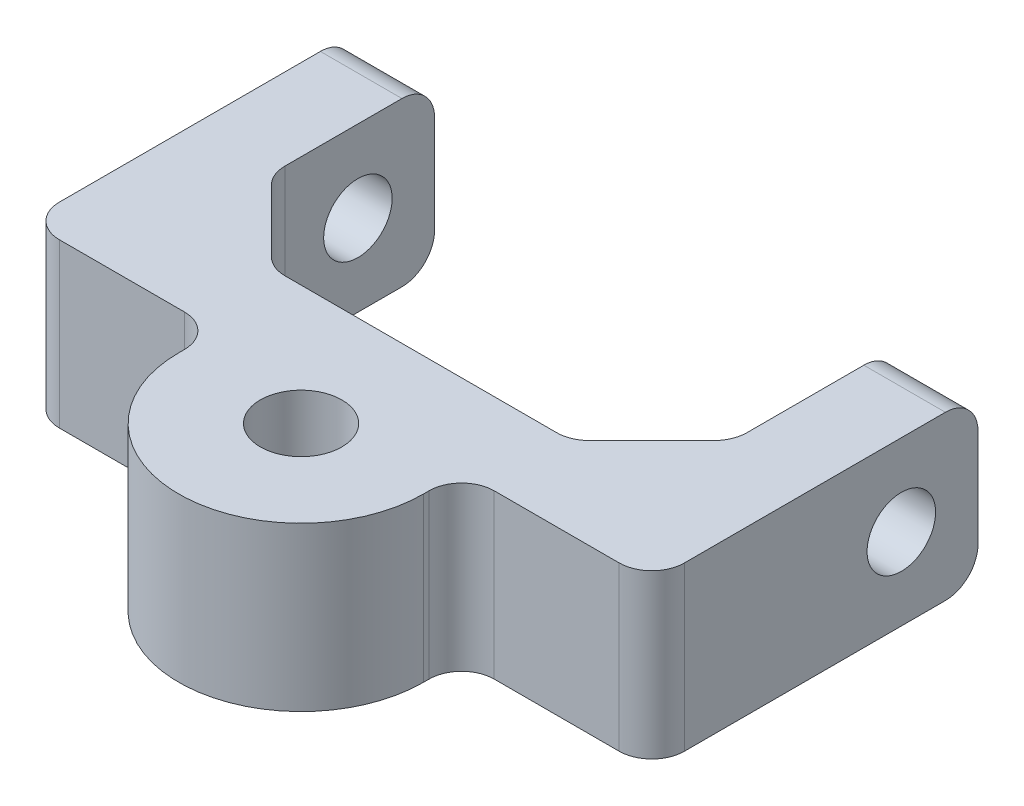
ISO-10303-21;
HEADER;
FILE_DESCRIPTION(('STEP AP214'),'2;1');
FILE_NAME('part.step','',(''),(''),'','','');
FILE_SCHEMA(('AUTOMOTIVE_DESIGN { 1 0 10303 214 1 1 1 1 }'));
ENDSEC;
DATA;
#1=APPLICATION_CONTEXT('core data for automotive mechanical design processes');
#2=APPLICATION_PROTOCOL_DEFINITION('international standard','automotive_design',2000,#1);
#3=PRODUCT_CONTEXT('',#1,'mechanical');
#4=PRODUCT('Part','Part','',(#3));
#5=PRODUCT_RELATED_PRODUCT_CATEGORY('part','',(#4));
#6=PRODUCT_DEFINITION_FORMATION('','',#4);
#7=PRODUCT_DEFINITION_CONTEXT('part definition',#1,'design');
#8=PRODUCT_DEFINITION('design','',#6,#7);
#9=PRODUCT_DEFINITION_SHAPE('','',#8);
#10=(LENGTH_UNIT() NAMED_UNIT(*) SI_UNIT(.MILLI.,.METRE.));
#11=(NAMED_UNIT(*) PLANE_ANGLE_UNIT() SI_UNIT($,.RADIAN.));
#12=(NAMED_UNIT(*) SI_UNIT($,.STERADIAN.) SOLID_ANGLE_UNIT());
#13=UNCERTAINTY_MEASURE_WITH_UNIT(LENGTH_MEASURE(1.E-05),#10,'distance_accuracy_value','');
#14=(GEOMETRIC_REPRESENTATION_CONTEXT(3) GLOBAL_UNCERTAINTY_ASSIGNED_CONTEXT((#13)) GLOBAL_UNIT_ASSIGNED_CONTEXT((#10,
#11,#12)) REPRESENTATION_CONTEXT('',''));
#15=CARTESIAN_POINT('',(0.,0.,0.));
#16=DIRECTION('',(0.,0.,1.));
#17=DIRECTION('',(1.,0.,0.));
#18=AXIS2_PLACEMENT_3D('',#15,#16,#17);
#19=CARTESIAN_POINT('',(-6.35,12.7,6.35));
#20=DIRECTION('',(0.,0.,-1.));
#21=DIRECTION('',(-1.,0.,0.));
#22=AXIS2_PLACEMENT_3D('',#19,#20,#21);
#23=PLANE('',#22);
#24=DIRECTION('',(1.,0.,0.));
#25=VECTOR('',#24,1.);
#26=CARTESIAN_POINT('',(-6.35,12.7,6.35));
#27=LINE('',#26,#25);
#28=CARTESIAN_POINT('',(-3.81,12.7,6.35));
#29=VERTEX_POINT('',#28);
#30=CARTESIAN_POINT('',(5.9182,12.7,6.35));
#31=VERTEX_POINT('',#30);
#32=EDGE_CURVE('E278',#29,#31,#27,.T.);
#33=ORIENTED_EDGE('',*,*,#32,.F.);
#34=DIRECTION('',(0.,-1.,0.));
#35=VECTOR('',#34,1.);
#36=CARTESIAN_POINT('',(-3.81,12.7,6.35));
#37=LINE('',#36,#35);
#38=CARTESIAN_POINT('',(-3.81,0.,6.35));
#39=VERTEX_POINT('',#38);
#40=EDGE_CURVE('E316',#29,#39,#37,.T.);
#41=ORIENTED_EDGE('',*,*,#40,.T.);
#42=DIRECTION('',(1.,0.,0.));
#43=VECTOR('',#42,1.);
#44=CARTESIAN_POINT('',(-6.35,0.,6.35));
#45=LINE('',#44,#43);
#46=CARTESIAN_POINT('',(5.9182,0.,6.35));
#47=VERTEX_POINT('',#46);
#48=EDGE_CURVE('E295',#39,#47,#45,.T.);
#49=ORIENTED_EDGE('',*,*,#48,.T.);
#50=DIRECTION('',(0.,-1.,0.));
#51=VECTOR('',#50,1.);
#52=CARTESIAN_POINT('',(5.9182,12.7,6.35));
#53=LINE('',#52,#51);
#54=EDGE_CURVE('E312',#47,#31,#53,.F.);
#55=ORIENTED_EDGE('',*,*,#54,.T.);
#56=EDGE_LOOP('',(#33,#41,#49,#55));
#57=FACE_BOUND('',#56,.T.);
#58=ADVANCED_FACE('F33',(#57),#23,.F.);
#59=CARTESIAN_POINT('',(0.,12.7,0.));
#60=DIRECTION('',(-1.,0.,0.));
#61=DIRECTION('',(0.,0.,1.));
#62=AXIS2_PLACEMENT_3D('',#59,#60,#61);
#63=PLANE('',#62);
#64=CARTESIAN_POINT('',(0.,6.35,-13.081));
#65=DIRECTION('',(-1.,0.,0.));
#66=DIRECTION('',(0.,0.,1.));
#67=AXIS2_PLACEMENT_3D('',#64,#65,#66);
#68=CIRCLE('',#67,2.667);
#69=CARTESIAN_POINT('',(0.,6.35,-10.414));
#70=VERTEX_POINT('',#69);
#71=EDGE_CURVE('E265',#70,#70,#68,.T.);
#72=ORIENTED_EDGE('',*,*,#71,.T.);
#73=EDGE_LOOP('',(#72));
#74=FACE_BOUND('',#73,.T.);
#75=DIRECTION('',(0.,-1.,0.));
#76=VECTOR('',#75,1.);
#77=CARTESIAN_POINT('',(0.,12.7,-19.05));
#78=LINE('',#77,#76);
#79=CARTESIAN_POINT('',(0.,10.16,-19.05));
#80=VERTEX_POINT('',#79);
#81=CARTESIAN_POINT('',(0.,2.54,-19.05));
#82=VERTEX_POINT('',#81);
#83=EDGE_CURVE('E309',#80,#82,#78,.T.);
#84=ORIENTED_EDGE('',*,*,#83,.F.);
#85=CARTESIAN_POINT('',(0.,10.16,-16.51));
#86=DIRECTION('',(-1.,0.,0.));
#87=DIRECTION('',(0.,0.,1.));
#88=AXIS2_PLACEMENT_3D('',#85,#86,#87);
#89=CIRCLE('',#88,2.54);
#90=CARTESIAN_POINT('',(0.,12.7,-16.51));
#91=VERTEX_POINT('',#90);
#92=EDGE_CURVE('E405',#80,#91,#89,.F.);
#93=ORIENTED_EDGE('',*,*,#92,.T.);
#94=DIRECTION('',(0.,0.,-1.));
#95=VECTOR('',#94,1.);
#96=CARTESIAN_POINT('',(0.,12.7,0.));
#97=LINE('',#96,#95);
#98=CARTESIAN_POINT('',(0.,12.7,-7.40210244842766));
#99=VERTEX_POINT('',#98);
#100=EDGE_CURVE('E269',#99,#91,#97,.T.);
#101=ORIENTED_EDGE('',*,*,#100,.F.);
#102=DIRECTION('',(0.,1.,0.));
#103=VECTOR('',#102,1.);
#104=CARTESIAN_POINT('',(0.,12.7,-7.40210244842766));
#105=LINE('',#104,#103);
#106=CARTESIAN_POINT('',(0.,0.,-7.40210244842766));
#107=VERTEX_POINT('',#106);
#108=EDGE_CURVE('E356',#99,#107,#105,.F.);
#109=ORIENTED_EDGE('',*,*,#108,.T.);
#110=DIRECTION('',(0.,0.,-1.));
#111=VECTOR('',#110,1.);
#112=CARTESIAN_POINT('',(0.,0.,0.));
#113=LINE('',#112,#111);
#114=CARTESIAN_POINT('',(0.,0.,-16.51));
#115=VERTEX_POINT('',#114);
#116=EDGE_CURVE('E268',#107,#115,#113,.T.);
#117=ORIENTED_EDGE('',*,*,#116,.T.);
#118=CARTESIAN_POINT('',(0.,2.54,-16.51));
#119=DIRECTION('',(-1.,0.,0.));
#120=DIRECTION('',(0.,0.,1.));
#121=AXIS2_PLACEMENT_3D('',#118,#119,#120);
#122=CIRCLE('',#121,2.54);
#123=EDGE_CURVE('E403',#115,#82,#122,.F.);
#124=ORIENTED_EDGE('',*,*,#123,.T.);
#125=EDGE_LOOP('',(#84,#93,#101,#109,#117,#124));
#126=FACE_BOUND('',#125,.T.);
#127=ADVANCED_FACE('F474',(#74,#126),#63,.F.);
#128=CARTESIAN_POINT('',(0.,12.7,-19.05));
#129=DIRECTION('',(0.,0.,1.));
#130=DIRECTION('',(1.,0.,0.));
#131=AXIS2_PLACEMENT_3D('',#128,#129,#130);
#132=PLANE('',#131);
#133=DIRECTION('',(0.,-1.,0.));
#134=VECTOR('',#133,1.);
#135=CARTESIAN_POINT('',(-6.35,12.7,-19.05));
#136=LINE('',#135,#134);
#137=CARTESIAN_POINT('',(-6.35,10.16,-19.05));
#138=VERTEX_POINT('',#137);
#139=CARTESIAN_POINT('',(-6.35,2.54,-19.05));
#140=VERTEX_POINT('',#139);
#141=EDGE_CURVE('E306',#138,#140,#136,.T.);
#142=ORIENTED_EDGE('',*,*,#141,.F.);
#143=DIRECTION('',(-1.,0.,0.));
#144=VECTOR('',#143,1.);
#145=CARTESIAN_POINT('',(0.,10.16,-19.05));
#146=LINE('',#145,#144);
#147=EDGE_CURVE('E401',#138,#80,#146,.F.);
#148=ORIENTED_EDGE('',*,*,#147,.T.);
#149=ORIENTED_EDGE('',*,*,#83,.T.);
#150=DIRECTION('',(-1.,0.,0.));
#151=VECTOR('',#150,1.);
#152=CARTESIAN_POINT('',(0.,2.54,-19.05));
#153=LINE('',#152,#151);
#154=EDGE_CURVE('E398',#82,#140,#153,.T.);
#155=ORIENTED_EDGE('',*,*,#154,.T.);
#156=EDGE_LOOP('',(#142,#148,#149,#155));
#157=FACE_BOUND('',#156,.T.);
#158=ADVANCED_FACE('F507',(#157),#132,.F.);
#159=CARTESIAN_POINT('',(-6.35,12.7,6.35));
#160=DIRECTION('',(1.,0.,0.));
#161=DIRECTION('',(0.,0.,-1.));
#162=AXIS2_PLACEMENT_3D('',#159,#160,#161);
#163=PLANE('',#162);
#164=CARTESIAN_POINT('',(-6.35,6.35,-13.081));
#165=DIRECTION('',(1.,0.,0.));
#166=DIRECTION('',(0.,0.,-1.));
#167=AXIS2_PLACEMENT_3D('',#164,#165,#166);
#168=CIRCLE('',#167,2.667);
#169=CARTESIAN_POINT('',(-6.35,6.35,-15.748));
#170=VERTEX_POINT('',#169);
#171=EDGE_CURVE('E259',#170,#170,#168,.T.);
#172=ORIENTED_EDGE('',*,*,#171,.T.);
#173=EDGE_LOOP('',(#172));
#174=FACE_BOUND('',#173,.T.);
#175=DIRECTION('',(0.,0.,1.));
#176=VECTOR('',#175,1.);
#177=CARTESIAN_POINT('',(-6.35,12.7,6.35));
#178=LINE('',#177,#176);
#179=CARTESIAN_POINT('',(-6.35,12.7,-16.51));
#180=VERTEX_POINT('',#179);
#181=CARTESIAN_POINT('',(-6.35,12.7,3.81));
#182=VERTEX_POINT('',#181);
#183=EDGE_CURVE('E272',#180,#182,#178,.T.);
#184=ORIENTED_EDGE('',*,*,#183,.F.);
#185=CARTESIAN_POINT('',(-6.35,10.16,-16.51));
#186=DIRECTION('',(1.,0.,0.));
#187=DIRECTION('',(0.,0.,-1.));
#188=AXIS2_PLACEMENT_3D('',#185,#186,#187);
#189=CIRCLE('',#188,2.54);
#190=EDGE_CURVE('E396',#180,#138,#189,.F.);
#191=ORIENTED_EDGE('',*,*,#190,.T.);
#192=ORIENTED_EDGE('',*,*,#141,.T.);
#193=CARTESIAN_POINT('',(-6.35,2.54,-16.51));
#194=DIRECTION('',(1.,0.,0.));
#195=DIRECTION('',(0.,0.,-1.));
#196=AXIS2_PLACEMENT_3D('',#193,#194,#195);
#197=CIRCLE('',#196,2.54);
#198=CARTESIAN_POINT('',(-6.35,0.,-16.51));
#199=VERTEX_POINT('',#198);
#200=EDGE_CURVE('E394',#140,#199,#197,.F.);
#201=ORIENTED_EDGE('',*,*,#200,.T.);
#202=DIRECTION('',(0.,0.,1.));
#203=VECTOR('',#202,1.);
#204=CARTESIAN_POINT('',(-6.35,0.,6.35));
#205=LINE('',#204,#203);
#206=CARTESIAN_POINT('',(-6.35,0.,3.81));
#207=VERTEX_POINT('',#206);
#208=EDGE_CURVE('E290',#199,#207,#205,.T.);
#209=ORIENTED_EDGE('',*,*,#208,.T.);
#210=DIRECTION('',(0.,-1.,0.));
#211=VECTOR('',#210,1.);
#212=CARTESIAN_POINT('',(-6.35,12.7,3.81));
#213=LINE('',#212,#211);
#214=EDGE_CURVE('E324',#207,#182,#213,.F.);
#215=ORIENTED_EDGE('',*,*,#214,.T.);
#216=EDGE_LOOP('',(#184,#191,#192,#201,#209,#215));
#217=FACE_BOUND('',#216,.T.);
#218=ADVANCED_FACE('F482',(#174,#217),#163,.F.);
#219=CARTESIAN_POINT('',(30.0482,0.,6.35));
#220=VERTEX_POINT('',#219);
#221=CARTESIAN_POINT('',(39.7764,0.,6.35));
#222=VERTEX_POINT('',#221);
#223=EDGE_CURVE('E292',#220,#222,#45,.T.);
#224=ORIENTED_EDGE('',*,*,#223,.T.);
#225=DIRECTION('',(0.,-1.,0.));
#226=VECTOR('',#225,1.);
#227=CARTESIAN_POINT('',(39.7764,12.7,6.35));
#228=LINE('',#227,#226);
#229=CARTESIAN_POINT('',(39.7764,12.7,6.35));
#230=VERTEX_POINT('',#229);
#231=EDGE_CURVE('E340',#222,#230,#228,.F.);
#232=ORIENTED_EDGE('',*,*,#231,.T.);
#233=CARTESIAN_POINT('',(30.0482,12.7,6.35));
#234=VERTEX_POINT('',#233);
#235=EDGE_CURVE('E275',#234,#230,#27,.T.);
#236=ORIENTED_EDGE('',*,*,#235,.F.);
#237=DIRECTION('',(0.,-1.,0.));
#238=VECTOR('',#237,1.);
#239=CARTESIAN_POINT('',(30.0482,12.7,6.35));
#240=LINE('',#239,#238);
#241=EDGE_CURVE('E337',#234,#220,#240,.T.);
#242=ORIENTED_EDGE('',*,*,#241,.T.);
#243=EDGE_LOOP('',(#224,#232,#236,#242));
#244=FACE_BOUND('',#243,.T.);
#245=ADVANCED_FACE('F514',(#244),#23,.F.);
#246=CARTESIAN_POINT('',(42.3164,12.7,6.35));
#247=DIRECTION('',(-1.,0.,0.));
#248=DIRECTION('',(0.,0.,1.));
#249=AXIS2_PLACEMENT_3D('',#246,#247,#248);
#250=PLANE('',#249);
#251=CARTESIAN_POINT('',(42.3164,6.35,-13.081));
#252=DIRECTION('',(1.,0.,0.));
#253=DIRECTION('',(0.,0.,-1.));
#254=AXIS2_PLACEMENT_3D('',#251,#252,#253);
#255=CIRCLE('',#254,2.667);
#256=CARTESIAN_POINT('',(42.3164,6.35,-15.748));
#257=VERTEX_POINT('',#256);
#258=EDGE_CURVE('E256',#257,#257,#255,.T.);
#259=ORIENTED_EDGE('',*,*,#258,.F.);
#260=EDGE_LOOP('',(#259));
#261=FACE_BOUND('',#260,.T.);
#262=DIRECTION('',(0.,-1.,0.));
#263=VECTOR('',#262,1.);
#264=CARTESIAN_POINT('',(42.3164,12.7,-19.05));
#265=LINE('',#264,#263);
#266=CARTESIAN_POINT('',(42.3164,10.16,-19.05));
#267=VERTEX_POINT('',#266);
#268=CARTESIAN_POINT('',(42.3164,2.54,-19.05));
#269=VERTEX_POINT('',#268);
#270=EDGE_CURVE('E304',#267,#269,#265,.T.);
#271=ORIENTED_EDGE('',*,*,#270,.F.);
#272=CARTESIAN_POINT('',(42.3164,10.16,-16.51));
#273=DIRECTION('',(-1.,0.,0.));
#274=DIRECTION('',(0.,0.,1.));
#275=AXIS2_PLACEMENT_3D('',#272,#273,#274);
#276=CIRCLE('',#275,2.54);
#277=CARTESIAN_POINT('',(42.3164,12.7,-16.51));
#278=VERTEX_POINT('',#277);
#279=EDGE_CURVE('E417',#267,#278,#276,.F.);
#280=ORIENTED_EDGE('',*,*,#279,.T.);
#281=DIRECTION('',(0.,0.,-1.));
#282=VECTOR('',#281,1.);
#283=CARTESIAN_POINT('',(42.3164,12.7,6.35));
#284=LINE('',#283,#282);
#285=CARTESIAN_POINT('',(42.3164,12.7,3.81));
#286=VERTEX_POINT('',#285);
#287=EDGE_CURVE('E279',#286,#278,#284,.T.);
#288=ORIENTED_EDGE('',*,*,#287,.F.);
#289=DIRECTION('',(0.,-1.,0.));
#290=VECTOR('',#289,1.);
#291=CARTESIAN_POINT('',(42.3164,12.7,3.81));
#292=LINE('',#291,#290);
#293=CARTESIAN_POINT('',(42.3164,0.,3.81));
#294=VERTEX_POINT('',#293);
#295=EDGE_CURVE('E334',#286,#294,#292,.T.);
#296=ORIENTED_EDGE('',*,*,#295,.T.);
#297=DIRECTION('',(0.,0.,-1.));
#298=VECTOR('',#297,1.);
#299=CARTESIAN_POINT('',(42.3164,0.,6.35));
#300=LINE('',#299,#298);
#301=CARTESIAN_POINT('',(42.3164,0.,-16.51));
#302=VERTEX_POINT('',#301);
#303=EDGE_CURVE('E296',#294,#302,#300,.T.);
#304=ORIENTED_EDGE('',*,*,#303,.T.);
#305=CARTESIAN_POINT('',(42.3164,2.54,-16.51));
#306=DIRECTION('',(-1.,0.,0.));
#307=DIRECTION('',(0.,0.,1.));
#308=AXIS2_PLACEMENT_3D('',#305,#306,#307);
#309=CIRCLE('',#308,2.54);
#310=EDGE_CURVE('E54',#302,#269,#309,.F.);
#311=ORIENTED_EDGE('',*,*,#310,.T.);
#312=EDGE_LOOP('',(#271,#280,#288,#296,#304,#311));
#313=FACE_BOUND('',#312,.T.);
#314=ADVANCED_FACE('F420',(#261,#313),#250,.F.);
#315=CARTESIAN_POINT('',(35.9664,12.7,-19.05));
#316=DIRECTION('',(0.,0.,1.));
#317=DIRECTION('',(1.,0.,0.));
#318=AXIS2_PLACEMENT_3D('',#315,#316,#317);
#319=PLANE('',#318);
#320=DIRECTION('',(0.,-1.,0.));
#321=VECTOR('',#320,1.);
#322=CARTESIAN_POINT('',(35.9664,12.7,-19.05));
#323=LINE('',#322,#321);
#324=CARTESIAN_POINT('',(35.9664,10.16,-19.05));
#325=VERTEX_POINT('',#324);
#326=CARTESIAN_POINT('',(35.9664,2.54,-19.05));
#327=VERTEX_POINT('',#326);
#328=EDGE_CURVE('E287',#325,#327,#323,.T.);
#329=ORIENTED_EDGE('',*,*,#328,.F.);
#330=DIRECTION('',(-1.,0.,0.));
#331=VECTOR('',#330,1.);
#332=CARTESIAN_POINT('',(42.3164,10.16,-19.05));
#333=LINE('',#332,#331);
#334=EDGE_CURVE('E414',#325,#267,#333,.F.);
#335=ORIENTED_EDGE('',*,*,#334,.T.);
#336=ORIENTED_EDGE('',*,*,#270,.T.);
#337=DIRECTION('',(-1.,0.,0.));
#338=VECTOR('',#337,1.);
#339=CARTESIAN_POINT('',(35.9664,2.54,-19.05));
#340=LINE('',#339,#338);
#341=EDGE_CURVE('E411',#269,#327,#340,.T.);
#342=ORIENTED_EDGE('',*,*,#341,.T.);
#343=EDGE_LOOP('',(#329,#335,#336,#342));
#344=FACE_BOUND('',#343,.T.);
#345=ADVANCED_FACE('F434',(#344),#319,.F.);
#346=CARTESIAN_POINT('',(35.9664,12.7,0.));
#347=DIRECTION('',(1.,0.,0.));
#348=DIRECTION('',(0.,0.,-1.));
#349=AXIS2_PLACEMENT_3D('',#346,#347,#348);
#350=PLANE('',#349);
#351=CARTESIAN_POINT('',(35.9664,6.35,-13.081));
#352=DIRECTION('',(1.,0.,0.));
#353=DIRECTION('',(0.,0.,-1.));
#354=AXIS2_PLACEMENT_3D('',#351,#352,#353);
#355=CIRCLE('',#354,2.667);
#356=CARTESIAN_POINT('',(35.9664,6.35,-15.748));
#357=VERTEX_POINT('',#356);
#358=EDGE_CURVE('E262',#357,#357,#355,.T.);
#359=ORIENTED_EDGE('',*,*,#358,.T.);
#360=EDGE_LOOP('',(#359));
#361=FACE_BOUND('',#360,.T.);
#362=DIRECTION('',(0.,0.,1.));
#363=VECTOR('',#362,1.);
#364=CARTESIAN_POINT('',(35.9664,12.7,0.));
#365=LINE('',#364,#363);
#366=CARTESIAN_POINT('',(35.9664,12.7,-16.51));
#367=VERTEX_POINT('',#366);
#368=CARTESIAN_POINT('',(35.9664,12.7,-7.40210244842766));
#369=VERTEX_POINT('',#368);
#370=EDGE_CURVE('E282',#367,#369,#365,.T.);
#371=ORIENTED_EDGE('',*,*,#370,.F.);
#372=CARTESIAN_POINT('',(35.9664,10.16,-16.51));
#373=DIRECTION('',(1.,0.,0.));
#374=DIRECTION('',(0.,0.,-1.));
#375=AXIS2_PLACEMENT_3D('',#372,#373,#374);
#376=CIRCLE('',#375,2.54);
#377=EDGE_CURVE('E409',#367,#325,#376,.F.);
#378=ORIENTED_EDGE('',*,*,#377,.T.);
#379=ORIENTED_EDGE('',*,*,#328,.T.);
#380=CARTESIAN_POINT('',(35.9664,2.54,-16.51));
#381=DIRECTION('',(1.,0.,0.));
#382=DIRECTION('',(0.,0.,-1.));
#383=AXIS2_PLACEMENT_3D('',#380,#381,#382);
#384=CIRCLE('',#383,2.54);
#385=CARTESIAN_POINT('',(35.9664,0.,-16.51));
#386=VERTEX_POINT('',#385);
#387=EDGE_CURVE('E407',#327,#386,#384,.F.);
#388=ORIENTED_EDGE('',*,*,#387,.T.);
#389=DIRECTION('',(0.,0.,1.));
#390=VECTOR('',#389,1.);
#391=CARTESIAN_POINT('',(35.9664,0.,0.));
#392=LINE('',#391,#390);
#393=CARTESIAN_POINT('',(35.9664,0.,-7.40210244842766));
#394=VERTEX_POINT('',#393);
#395=EDGE_CURVE('E298',#386,#394,#392,.T.);
#396=ORIENTED_EDGE('',*,*,#395,.T.);
#397=DIRECTION('',(0.,1.,0.));
#398=VECTOR('',#397,1.);
#399=CARTESIAN_POINT('',(35.9664,12.7,-7.40210244842766));
#400=LINE('',#399,#398);
#401=EDGE_CURVE('E368',#394,#369,#400,.T.);
#402=ORIENTED_EDGE('',*,*,#401,.T.);
#403=EDGE_LOOP('',(#371,#378,#379,#388,#396,#402));
#404=FACE_BOUND('',#403,.T.);
#405=ADVANCED_FACE('F432',(#361,#404),#350,.F.);
#406=CARTESIAN_POINT('',(0.,12.7,0.));
#407=DIRECTION('',(0.,0.,1.));
#408=DIRECTION('',(1.,0.,0.));
#409=AXIS2_PLACEMENT_3D('',#406,#407,#408);
#410=PLANE('',#409);
#411=DIRECTION('',(-1.,0.,0.));
#412=VECTOR('',#411,1.);
#413=CARTESIAN_POINT('',(0.,0.,0.));
#414=LINE('',#413,#412);
#415=CARTESIAN_POINT('',(28.5642975515723,0.,0.));
#416=VERTEX_POINT('',#415);
#417=CARTESIAN_POINT('',(7.40210244842766,0.,0.));
#418=VERTEX_POINT('',#417);
#419=EDGE_CURVE('E273',#416,#418,#414,.T.);
#420=ORIENTED_EDGE('',*,*,#419,.T.);
#421=DIRECTION('',(0.,1.,0.));
#422=VECTOR('',#421,1.);
#423=CARTESIAN_POINT('',(7.40210244842766,12.7,0.));
#424=LINE('',#423,#422);
#425=CARTESIAN_POINT('',(7.40210244842766,12.7,0.));
#426=VERTEX_POINT('',#425);
#427=EDGE_CURVE('E360',#418,#426,#424,.T.);
#428=ORIENTED_EDGE('',*,*,#427,.T.);
#429=DIRECTION('',(-1.,0.,0.));
#430=VECTOR('',#429,1.);
#431=CARTESIAN_POINT('',(0.,12.7,0.));
#432=LINE('',#431,#430);
#433=CARTESIAN_POINT('',(28.5642975515723,12.7,0.));
#434=VERTEX_POINT('',#433);
#435=EDGE_CURVE('E284',#434,#426,#432,.T.);
#436=ORIENTED_EDGE('',*,*,#435,.F.);
#437=DIRECTION('',(0.,1.,0.));
#438=VECTOR('',#437,1.);
#439=CARTESIAN_POINT('',(28.5642975515723,12.7,0.));
#440=LINE('',#439,#438);
#441=EDGE_CURVE('E358',#434,#416,#440,.F.);
#442=ORIENTED_EDGE('',*,*,#441,.T.);
#443=EDGE_LOOP('',(#420,#428,#436,#442));
#444=FACE_BOUND('',#443,.T.);
#445=ADVANCED_FACE('F454',(#444),#410,.F.);
#446=CARTESIAN_POINT('',(0.,12.7,0.));
#447=DIRECTION('',(0.,1.,0.));
#448=DIRECTION('',(0.,0.,1.));
#449=AXIS2_PLACEMENT_3D('',#446,#447,#448);
#450=PLANE('',#449);
#451=CARTESIAN_POINT('',(17.9832,12.7,9.32613509013436));
#452=DIRECTION('',(0.,1.,0.));
#453=DIRECTION('',(0.,0.,1.));
#454=AXIS2_PLACEMENT_3D('',#451,#452,#453);
#455=CIRCLE('',#454,3.175);
#456=CARTESIAN_POINT('',(17.9832,12.7,12.5011350901344));
#457=VERTEX_POINT('',#456);
#458=EDGE_CURVE('E238',#457,#457,#455,.F.);
#459=ORIENTED_EDGE('',*,*,#458,.T.);
#460=EDGE_LOOP('',(#459));
#461=FACE_BOUND('',#460,.T.);
#462=ORIENTED_EDGE('',*,*,#100,.T.);
#463=DIRECTION('',(-1.,0.,0.));
#464=VECTOR('',#463,1.);
#465=CARTESIAN_POINT('',(-6.35,12.7,-16.51));
#466=LINE('',#465,#464);
#467=EDGE_CURVE('E391',#91,#180,#466,.T.);
#468=ORIENTED_EDGE('',*,*,#467,.T.);
#469=ORIENTED_EDGE('',*,*,#183,.T.);
#470=CARTESIAN_POINT('',(-3.81,12.7,3.81));
#471=DIRECTION('',(0.,1.,0.));
#472=DIRECTION('',(0.,0.,1.));
#473=AXIS2_PLACEMENT_3D('',#470,#471,#472);
#474=CIRCLE('',#473,2.54);
#475=EDGE_CURVE('E329',#182,#29,#474,.T.);
#476=ORIENTED_EDGE('',*,*,#475,.T.);
#477=ORIENTED_EDGE('',*,*,#32,.T.);
#478=CARTESIAN_POINT('',(5.9182,12.7,8.89));
#479=DIRECTION('',(0.,1.,0.));
#480=DIRECTION('',(0.,0.,1.));
#481=AXIS2_PLACEMENT_3D('',#478,#479,#480);
#482=CIRCLE('',#481,2.54);
#483=CARTESIAN_POINT('',(8.45820000000001,12.7,8.89));
#484=VERTEX_POINT('',#483);
#485=EDGE_CURVE('E346',#31,#484,#482,.F.);
#486=ORIENTED_EDGE('',*,*,#485,.T.);
#487=DIRECTION('',(0.,0.,-1.));
#488=VECTOR('',#487,1.);
#489=CARTESIAN_POINT('',(8.45820000000001,12.7,9.32613509013436));
#490=LINE('',#489,#488);
#491=CARTESIAN_POINT('',(8.45820000000001,12.7,9.32613509013436));
#492=VERTEX_POINT('',#491);
#493=EDGE_CURVE('E217',#492,#484,#490,.T.);
#494=ORIENTED_EDGE('',*,*,#493,.F.);
#495=CARTESIAN_POINT('',(17.9832,12.7,9.32613509013436));
#496=DIRECTION('',(0.,1.,0.));
#497=DIRECTION('',(0.,0.,1.));
#498=AXIS2_PLACEMENT_3D('',#495,#496,#497);
#499=CIRCLE('',#498,9.525);
#500=CARTESIAN_POINT('',(27.5082,12.7,9.32613509013436));
#501=VERTEX_POINT('',#500);
#502=EDGE_CURVE('E228',#501,#492,#499,.F.);
#503=ORIENTED_EDGE('',*,*,#502,.F.);
#504=DIRECTION('',(0.,0.,1.));
#505=VECTOR('',#504,1.);
#506=CARTESIAN_POINT('',(27.5082,12.7,9.32613509013436));
#507=LINE('',#506,#505);
#508=CARTESIAN_POINT('',(27.5082,12.7,8.89));
#509=VERTEX_POINT('',#508);
#510=EDGE_CURVE('E224',#509,#501,#507,.T.);
#511=ORIENTED_EDGE('',*,*,#510,.F.);
#512=CARTESIAN_POINT('',(30.0482,12.7,8.89));
#513=DIRECTION('',(0.,1.,0.));
#514=DIRECTION('',(0.,0.,1.));
#515=AXIS2_PLACEMENT_3D('',#512,#513,#514);
#516=CIRCLE('',#515,2.54);
#517=EDGE_CURVE('E349',#509,#234,#516,.F.);
#518=ORIENTED_EDGE('',*,*,#517,.T.);
#519=ORIENTED_EDGE('',*,*,#235,.T.);
#520=CARTESIAN_POINT('',(39.7764,12.7,3.81));
#521=DIRECTION('',(0.,1.,0.));
#522=DIRECTION('',(0.,0.,1.));
#523=AXIS2_PLACEMENT_3D('',#520,#521,#522);
#524=CIRCLE('',#523,2.54);
#525=EDGE_CURVE('E327',#230,#286,#524,.T.);
#526=ORIENTED_EDGE('',*,*,#525,.T.);
#527=ORIENTED_EDGE('',*,*,#287,.T.);
#528=DIRECTION('',(-1.,0.,0.));
#529=VECTOR('',#528,1.);
#530=CARTESIAN_POINT('',(35.9664,12.7,-16.51));
#531=LINE('',#530,#529);
#532=EDGE_CURVE('E388',#278,#367,#531,.T.);
#533=ORIENTED_EDGE('',*,*,#532,.T.);
#534=ORIENTED_EDGE('',*,*,#370,.T.);
#535=CARTESIAN_POINT('',(33.4264,12.7,-7.40210244842766));
#536=DIRECTION('',(0.,1.,0.));
#537=DIRECTION('',(0.,0.,1.));
#538=AXIS2_PLACEMENT_3D('',#535,#536,#537);
#539=CIRCLE('',#538,2.54);
#540=CARTESIAN_POINT('',(35.2224512242138,12.7,-5.60605122421383));
#541=VERTEX_POINT('',#540);
#542=EDGE_CURVE('E383',#369,#541,#539,.F.);
#543=ORIENTED_EDGE('',*,*,#542,.T.);
#544=DIRECTION('',(-0.707106781186548,0.,0.707106781186547));
#545=VECTOR('',#544,1.);
#546=CARTESIAN_POINT('',(35.9664,12.7,-6.35));
#547=LINE('',#546,#545);
#548=CARTESIAN_POINT('',(30.3603487757862,12.7,-0.743948775786169));
#549=VERTEX_POINT('',#548);
#550=EDGE_CURVE('E246',#541,#549,#547,.T.);
#551=ORIENTED_EDGE('',*,*,#550,.T.);
#552=CARTESIAN_POINT('',(28.5642975515723,12.7,-2.54));
#553=DIRECTION('',(0.,1.,0.));
#554=DIRECTION('',(0.,0.,1.));
#555=AXIS2_PLACEMENT_3D('',#552,#553,#554);
#556=CIRCLE('',#555,2.54);
#557=EDGE_CURVE('E379',#549,#434,#556,.F.);
#558=ORIENTED_EDGE('',*,*,#557,.T.);
#559=ORIENTED_EDGE('',*,*,#435,.T.);
#560=CARTESIAN_POINT('',(7.40210244842766,12.7,-2.54));
#561=DIRECTION('',(0.,1.,0.));
#562=DIRECTION('',(0.,0.,1.));
#563=AXIS2_PLACEMENT_3D('',#560,#561,#562);
#564=CIRCLE('',#563,2.54);
#565=CARTESIAN_POINT('',(5.60605122421383,12.7,-0.743948775786171));
#566=VERTEX_POINT('',#565);
#567=EDGE_CURVE('E375',#426,#566,#564,.F.);
#568=ORIENTED_EDGE('',*,*,#567,.T.);
#569=DIRECTION('',(-0.707106781186547,0.,-0.707106781186547));
#570=VECTOR('',#569,1.);
#571=CARTESIAN_POINT('',(0.,12.7,-6.35));
#572=LINE('',#571,#570);
#573=CARTESIAN_POINT('',(0.74394877578617,12.7,-5.60605122421383));
#574=VERTEX_POINT('',#573);
#575=EDGE_CURVE('E252',#566,#574,#572,.T.);
#576=ORIENTED_EDGE('',*,*,#575,.T.);
#577=CARTESIAN_POINT('',(2.54,12.7,-7.40210244842766));
#578=DIRECTION('',(0.,1.,0.));
#579=DIRECTION('',(0.,0.,1.));
#580=AXIS2_PLACEMENT_3D('',#577,#578,#579);
#581=CIRCLE('',#580,2.54);
#582=EDGE_CURVE('E371',#574,#99,#581,.F.);
#583=ORIENTED_EDGE('',*,*,#582,.T.);
#584=EDGE_LOOP('',(#462,#468,#469,#476,#477,#486,#494,#503,#511,#518,#519,#526,#527,#533,#534,
#543,#551,#558,#559,#568,#576,#583));
#585=FACE_BOUND('',#584,.T.);
#586=ADVANCED_FACE('F426',(#461,#585),#450,.T.);
#587=CARTESIAN_POINT('',(0.,0.,0.));
#588=DIRECTION('',(0.,1.,0.));
#589=DIRECTION('',(0.,0.,1.));
#590=AXIS2_PLACEMENT_3D('',#587,#588,#589);
#591=PLANE('',#590);
#592=CARTESIAN_POINT('',(17.9832,0.,9.32613509013436));
#593=DIRECTION('',(0.,-1.,0.));
#594=DIRECTION('',(0.,0.,-1.));
#595=AXIS2_PLACEMENT_3D('',#592,#593,#594);
#596=CIRCLE('',#595,3.175);
#597=CARTESIAN_POINT('',(17.9832,0.,6.15113509013436));
#598=VERTEX_POINT('',#597);
#599=EDGE_CURVE('E234',#598,#598,#596,.T.);
#600=ORIENTED_EDGE('',*,*,#599,.F.);
#601=EDGE_LOOP('',(#600));
#602=FACE_BOUND('',#601,.T.);
#603=ORIENTED_EDGE('',*,*,#208,.F.);
#604=DIRECTION('',(-1.,0.,0.));
#605=VECTOR('',#604,1.);
#606=CARTESIAN_POINT('',(0.,0.,-16.51));
#607=LINE('',#606,#605);
#608=EDGE_CURVE('E11',#199,#115,#607,.F.);
#609=ORIENTED_EDGE('',*,*,#608,.T.);
#610=ORIENTED_EDGE('',*,*,#116,.F.);
#611=CARTESIAN_POINT('',(2.54,0.,-7.40210244842766));
#612=DIRECTION('',(0.,1.,0.));
#613=DIRECTION('',(0.,0.,1.));
#614=AXIS2_PLACEMENT_3D('',#611,#612,#613);
#615=CIRCLE('',#614,2.54);
#616=CARTESIAN_POINT('',(0.74394877578617,0.,-5.60605122421383));
#617=VERTEX_POINT('',#616);
#618=EDGE_CURVE('E373',#107,#617,#615,.T.);
#619=ORIENTED_EDGE('',*,*,#618,.T.);
#620=DIRECTION('',(0.707106781186548,0.,0.707106781186548));
#621=VECTOR('',#620,1.);
#622=CARTESIAN_POINT('',(0.,0.,-6.35));
#623=LINE('',#622,#621);
#624=CARTESIAN_POINT('',(5.60605122421383,0.,-0.743948775786169));
#625=VERTEX_POINT('',#624);
#626=EDGE_CURVE('E253',#617,#625,#623,.T.);
#627=ORIENTED_EDGE('',*,*,#626,.T.);
#628=CARTESIAN_POINT('',(7.40210244842766,0.,-2.54));
#629=DIRECTION('',(0.,1.,0.));
#630=DIRECTION('',(0.,0.,1.));
#631=AXIS2_PLACEMENT_3D('',#628,#629,#630);
#632=CIRCLE('',#631,2.54);
#633=EDGE_CURVE('E377',#625,#418,#632,.T.);
#634=ORIENTED_EDGE('',*,*,#633,.T.);
#635=ORIENTED_EDGE('',*,*,#419,.F.);
#636=CARTESIAN_POINT('',(28.5642975515723,0.,-2.54));
#637=DIRECTION('',(0.,1.,0.));
#638=DIRECTION('',(0.,0.,1.));
#639=AXIS2_PLACEMENT_3D('',#636,#637,#638);
#640=CIRCLE('',#639,2.54);
#641=CARTESIAN_POINT('',(30.3603487757862,0.,-0.743948775786171));
#642=VERTEX_POINT('',#641);
#643=EDGE_CURVE('E381',#416,#642,#640,.T.);
#644=ORIENTED_EDGE('',*,*,#643,.T.);
#645=DIRECTION('',(0.707106781186548,0.,-0.707106781186547));
#646=VECTOR('',#645,1.);
#647=CARTESIAN_POINT('',(35.9664,0.,-6.35));
#648=LINE('',#647,#646);
#649=CARTESIAN_POINT('',(35.2224512242138,0.,-5.60605122421383));
#650=VERTEX_POINT('',#649);
#651=EDGE_CURVE('E249',#642,#650,#648,.T.);
#652=ORIENTED_EDGE('',*,*,#651,.T.);
#653=CARTESIAN_POINT('',(33.4264,0.,-7.40210244842766));
#654=DIRECTION('',(0.,1.,0.));
#655=DIRECTION('',(0.,0.,1.));
#656=AXIS2_PLACEMENT_3D('',#653,#654,#655);
#657=CIRCLE('',#656,2.54);
#658=EDGE_CURVE('E385',#650,#394,#657,.T.);
#659=ORIENTED_EDGE('',*,*,#658,.T.);
#660=ORIENTED_EDGE('',*,*,#395,.F.);
#661=DIRECTION('',(-1.,0.,0.));
#662=VECTOR('',#661,1.);
#663=CARTESIAN_POINT('',(0.,0.,-16.51));
#664=LINE('',#663,#662);
#665=EDGE_CURVE('E41',#386,#302,#664,.F.);
#666=ORIENTED_EDGE('',*,*,#665,.T.);
#667=ORIENTED_EDGE('',*,*,#303,.F.);
#668=CARTESIAN_POINT('',(39.7764,0.,3.81));
#669=DIRECTION('',(0.,1.,0.));
#670=DIRECTION('',(0.,0.,1.));
#671=AXIS2_PLACEMENT_3D('',#668,#669,#670);
#672=CIRCLE('',#671,2.54);
#673=EDGE_CURVE('E319',#294,#222,#672,.F.);
#674=ORIENTED_EDGE('',*,*,#673,.T.);
#675=ORIENTED_EDGE('',*,*,#223,.F.);
#676=CARTESIAN_POINT('',(30.0482,0.,8.89));
#677=DIRECTION('',(0.,1.,0.));
#678=DIRECTION('',(0.,0.,1.));
#679=AXIS2_PLACEMENT_3D('',#676,#677,#678);
#680=CIRCLE('',#679,2.54);
#681=CARTESIAN_POINT('',(27.5082,0.,8.89));
#682=VERTEX_POINT('',#681);
#683=EDGE_CURVE('E214',#220,#682,#680,.T.);
#684=ORIENTED_EDGE('',*,*,#683,.T.);
#685=DIRECTION('',(0.,0.,1.));
#686=VECTOR('',#685,1.);
#687=CARTESIAN_POINT('',(27.5082,0.,9.32613509013436));
#688=LINE('',#687,#686);
#689=CARTESIAN_POINT('',(27.5082,0.,9.32613509013436));
#690=VERTEX_POINT('',#689);
#691=EDGE_CURVE('E206',#682,#690,#688,.T.);
#692=ORIENTED_EDGE('',*,*,#691,.T.);
#693=CARTESIAN_POINT('',(17.9832,0.,9.32613509013436));
#694=DIRECTION('',(0.,-1.,0.));
#695=DIRECTION('',(0.,0.,-1.));
#696=AXIS2_PLACEMENT_3D('',#693,#694,#695);
#697=CIRCLE('',#696,9.525);
#698=CARTESIAN_POINT('',(8.45820000000001,0.,9.32613509013436));
#699=VERTEX_POINT('',#698);
#700=EDGE_CURVE('E212',#690,#699,#697,.T.);
#701=ORIENTED_EDGE('',*,*,#700,.T.);
#702=DIRECTION('',(0.,0.,-1.));
#703=VECTOR('',#702,1.);
#704=CARTESIAN_POINT('',(8.45820000000001,0.,9.32613509013436));
#705=LINE('',#704,#703);
#706=CARTESIAN_POINT('',(8.45820000000001,0.,8.89));
#707=VERTEX_POINT('',#706);
#708=EDGE_CURVE('E218',#699,#707,#705,.T.);
#709=ORIENTED_EDGE('',*,*,#708,.T.);
#710=CARTESIAN_POINT('',(5.9182,0.,8.89));
#711=DIRECTION('',(0.,1.,0.));
#712=DIRECTION('',(0.,0.,1.));
#713=AXIS2_PLACEMENT_3D('',#710,#711,#712);
#714=CIRCLE('',#713,2.54);
#715=EDGE_CURVE('E344',#707,#47,#714,.T.);
#716=ORIENTED_EDGE('',*,*,#715,.T.);
#717=ORIENTED_EDGE('',*,*,#48,.F.);
#718=CARTESIAN_POINT('',(-3.81,0.,3.81));
#719=DIRECTION('',(0.,1.,0.));
#720=DIRECTION('',(0.,0.,1.));
#721=AXIS2_PLACEMENT_3D('',#718,#719,#720);
#722=CIRCLE('',#721,2.54);
#723=EDGE_CURVE('E321',#39,#207,#722,.F.);
#724=ORIENTED_EDGE('',*,*,#723,.T.);
#725=EDGE_LOOP('',(#603,#609,#610,#619,#627,#634,#635,#644,#652,#659,#660,#666,#667,#674,#675,
#684,#692,#701,#709,#716,#717,#724));
#726=FACE_BOUND('',#725,.T.);
#727=ADVANCED_FACE('F209',(#602,#726),#591,.F.);
#728=CARTESIAN_POINT('',(-6.35,6.35,-13.081));
#729=DIRECTION('',(1.,0.,0.));
#730=DIRECTION('',(0.,0.,-1.));
#731=AXIS2_PLACEMENT_3D('',#728,#729,#730);
#732=CYLINDRICAL_SURFACE('',#731,2.667);
#733=ORIENTED_EDGE('',*,*,#258,.T.);
#734=EDGE_LOOP('',(#733));
#735=FACE_BOUND('',#734,.T.);
#736=ORIENTED_EDGE('',*,*,#358,.F.);
#737=EDGE_LOOP('',(#736));
#738=FACE_BOUND('',#737,.T.);
#739=ADVANCED_FACE('F590',(#735,#738),#732,.F.);
#740=ORIENTED_EDGE('',*,*,#171,.F.);
#741=EDGE_LOOP('',(#740));
#742=FACE_BOUND('',#741,.T.);
#743=ORIENTED_EDGE('',*,*,#71,.F.);
#744=EDGE_LOOP('',(#743));
#745=FACE_BOUND('',#744,.T.);
#746=ADVANCED_FACE('F689',(#742,#745),#732,.F.);
#747=CARTESIAN_POINT('',(0.,-8.98025612106915,-6.35));
#748=DIRECTION('',(0.707106781186547,0.,-0.707106781186547));
#749=DIRECTION('',(-0.707106781186548,0.,-0.707106781186548));
#750=AXIS2_PLACEMENT_3D('',#747,#748,#749);
#751=PLANE('',#750);
#752=ORIENTED_EDGE('',*,*,#626,.F.);
#753=DIRECTION('',(0.,1.,0.));
#754=VECTOR('',#753,1.);
#755=CARTESIAN_POINT('',(0.74394877578617,-8.98025612106915,-5.60605122421383));
#756=LINE('',#755,#754);
#757=EDGE_CURVE('E353',#617,#574,#756,.T.);
#758=ORIENTED_EDGE('',*,*,#757,.T.);
#759=ORIENTED_EDGE('',*,*,#575,.F.);
#760=DIRECTION('',(0.,1.,0.));
#761=VECTOR('',#760,1.);
#762=CARTESIAN_POINT('',(5.60605122421383,-8.98025612106915,-0.74394877578617));
#763=LINE('',#762,#761);
#764=EDGE_CURVE('E351',#566,#625,#763,.F.);
#765=ORIENTED_EDGE('',*,*,#764,.T.);
#766=EDGE_LOOP('',(#752,#758,#759,#765));
#767=FACE_BOUND('',#766,.T.);
#768=ADVANCED_FACE('F464',(#767),#751,.T.);
#769=CARTESIAN_POINT('',(35.9664,-8.98025612106915,-6.35));
#770=DIRECTION('',(-0.707106781186547,0.,-0.707106781186548));
#771=DIRECTION('',(-0.707106781186548,0.,0.707106781186547));
#772=AXIS2_PLACEMENT_3D('',#769,#770,#771);
#773=PLANE('',#772);
#774=ORIENTED_EDGE('',*,*,#651,.F.);
#775=DIRECTION('',(0.,1.,0.));
#776=VECTOR('',#775,1.);
#777=CARTESIAN_POINT('',(30.3603487757862,-8.98025612106915,-0.743948775786171));
#778=LINE('',#777,#776);
#779=EDGE_CURVE('E365',#642,#549,#778,.T.);
#780=ORIENTED_EDGE('',*,*,#779,.T.);
#781=ORIENTED_EDGE('',*,*,#550,.F.);
#782=DIRECTION('',(0.,1.,0.));
#783=VECTOR('',#782,1.);
#784=CARTESIAN_POINT('',(35.2224512242138,-8.98025612106915,-5.60605122421383));
#785=LINE('',#784,#783);
#786=EDGE_CURVE('E363',#541,#650,#785,.F.);
#787=ORIENTED_EDGE('',*,*,#786,.T.);
#788=EDGE_LOOP('',(#774,#780,#781,#787));
#789=FACE_BOUND('',#788,.T.);
#790=ADVANCED_FACE('F446',(#789),#773,.T.);
#791=CARTESIAN_POINT('',(8.45820000000001,35.4855409973472,9.32613509013436));
#792=DIRECTION('',(-1.,0.,0.));
#793=DIRECTION('',(0.,0.,1.));
#794=AXIS2_PLACEMENT_3D('',#791,#792,#793);
#795=PLANE('',#794);
#796=ORIENTED_EDGE('',*,*,#493,.T.);
#797=DIRECTION('',(0.,-1.,0.));
#798=VECTOR('',#797,1.);
#799=CARTESIAN_POINT('',(8.45820000000001,35.4855409973472,8.89));
#800=LINE('',#799,#798);
#801=EDGE_CURVE('E331',#484,#707,#800,.T.);
#802=ORIENTED_EDGE('',*,*,#801,.T.);
#803=ORIENTED_EDGE('',*,*,#708,.F.);
#804=DIRECTION('',(0.,-1.,0.));
#805=VECTOR('',#804,1.);
#806=CARTESIAN_POINT('',(8.45820000000001,35.4855409973472,9.32613509013436));
#807=LINE('',#806,#805);
#808=EDGE_CURVE('E232',#492,#699,#807,.T.);
#809=ORIENTED_EDGE('',*,*,#808,.F.);
#810=EDGE_LOOP('',(#796,#802,#803,#809));
#811=FACE_BOUND('',#810,.T.);
#812=ADVANCED_FACE('F500',(#811),#795,.T.);
#813=CARTESIAN_POINT('',(27.5082,35.4855409973472,9.32613509013436));
#814=DIRECTION('',(1.,0.,0.));
#815=DIRECTION('',(0.,0.,-1.));
#816=AXIS2_PLACEMENT_3D('',#813,#814,#815);
#817=PLANE('',#816);
#818=ORIENTED_EDGE('',*,*,#691,.F.);
#819=DIRECTION('',(0.,-1.,0.));
#820=VECTOR('',#819,1.);
#821=CARTESIAN_POINT('',(27.5082,35.4855409973472,8.89));
#822=LINE('',#821,#820);
#823=EDGE_CURVE('E342',#682,#509,#822,.F.);
#824=ORIENTED_EDGE('',*,*,#823,.T.);
#825=ORIENTED_EDGE('',*,*,#510,.T.);
#826=DIRECTION('',(0.,-1.,0.));
#827=VECTOR('',#826,1.);
#828=CARTESIAN_POINT('',(27.5082,35.4855409973472,9.32613509013436));
#829=LINE('',#828,#827);
#830=EDGE_CURVE('E221',#501,#690,#829,.T.);
#831=ORIENTED_EDGE('',*,*,#830,.T.);
#832=EDGE_LOOP('',(#818,#824,#825,#831));
#833=FACE_BOUND('',#832,.T.);
#834=ADVANCED_FACE('F222',(#833),#817,.T.);
#835=CARTESIAN_POINT('',(17.9832,35.4855409973472,9.32613509013436));
#836=DIRECTION('',(0.,-1.,0.));
#837=DIRECTION('',(0.,0.,-1.));
#838=AXIS2_PLACEMENT_3D('',#835,#836,#837);
#839=CYLINDRICAL_SURFACE('',#838,9.525);
#840=ORIENTED_EDGE('',*,*,#830,.F.);
#841=ORIENTED_EDGE('',*,*,#502,.T.);
#842=ORIENTED_EDGE('',*,*,#808,.T.);
#843=ORIENTED_EDGE('',*,*,#700,.F.);
#844=EDGE_LOOP('',(#840,#841,#842,#843));
#845=FACE_BOUND('',#844,.T.);
#846=ADVANCED_FACE('F230',(#845),#839,.T.);
#847=CARTESIAN_POINT('',(17.9832,12.701,9.32613509013436));
#848=DIRECTION('',(0.,-1.,0.));
#849=DIRECTION('',(0.,0.,-1.));
#850=AXIS2_PLACEMENT_3D('',#847,#848,#849);
#851=CYLINDRICAL_SURFACE('',#850,3.175);
#852=ORIENTED_EDGE('',*,*,#458,.F.);
#853=EDGE_LOOP('',(#852));
#854=FACE_BOUND('',#853,.T.);
#855=ORIENTED_EDGE('',*,*,#599,.T.);
#856=EDGE_LOOP('',(#855));
#857=FACE_BOUND('',#856,.T.);
#858=ADVANCED_FACE('F721',(#854,#857),#851,.F.);
#859=CARTESIAN_POINT('',(-3.81,12.7,3.81));
#860=DIRECTION('',(0.,-1.,0.));
#861=DIRECTION('',(0.,0.,-1.));
#862=AXIS2_PLACEMENT_3D('',#859,#860,#861);
#863=CYLINDRICAL_SURFACE('',#862,2.54);
#864=ORIENTED_EDGE('',*,*,#475,.F.);
#865=ORIENTED_EDGE('',*,*,#214,.F.);
#866=ORIENTED_EDGE('',*,*,#723,.F.);
#867=ORIENTED_EDGE('',*,*,#40,.F.);
#868=EDGE_LOOP('',(#864,#865,#866,#867));
#869=FACE_BOUND('',#868,.T.);
#870=ADVANCED_FACE('F488',(#869),#863,.T.);
#871=CARTESIAN_POINT('',(5.9182,35.4855409973472,8.89));
#872=DIRECTION('',(0.,-1.,0.));
#873=DIRECTION('',(0.,0.,-1.));
#874=AXIS2_PLACEMENT_3D('',#871,#872,#873);
#875=CYLINDRICAL_SURFACE('',#874,2.54);
#876=ORIENTED_EDGE('',*,*,#485,.F.);
#877=ORIENTED_EDGE('',*,*,#54,.F.);
#878=ORIENTED_EDGE('',*,*,#715,.F.);
#879=ORIENTED_EDGE('',*,*,#801,.F.);
#880=EDGE_LOOP('',(#876,#877,#878,#879));
#881=FACE_BOUND('',#880,.T.);
#882=ADVANCED_FACE('F497',(#881),#875,.F.);
#883=CARTESIAN_POINT('',(39.7764,12.7,3.81));
#884=DIRECTION('',(0.,-1.,0.));
#885=DIRECTION('',(0.,0.,-1.));
#886=AXIS2_PLACEMENT_3D('',#883,#884,#885);
#887=CYLINDRICAL_SURFACE('',#886,2.54);
#888=ORIENTED_EDGE('',*,*,#525,.F.);
#889=ORIENTED_EDGE('',*,*,#231,.F.);
#890=ORIENTED_EDGE('',*,*,#673,.F.);
#891=ORIENTED_EDGE('',*,*,#295,.F.);
#892=EDGE_LOOP('',(#888,#889,#890,#891));
#893=FACE_BOUND('',#892,.T.);
#894=ADVANCED_FACE('F534',(#893),#887,.T.);
#895=CARTESIAN_POINT('',(30.0482,12.7,8.89));
#896=DIRECTION('',(0.,-1.,0.));
#897=DIRECTION('',(0.,0.,-1.));
#898=AXIS2_PLACEMENT_3D('',#895,#896,#897);
#899=CYLINDRICAL_SURFACE('',#898,2.54);
#900=ORIENTED_EDGE('',*,*,#517,.F.);
#901=ORIENTED_EDGE('',*,*,#823,.F.);
#902=ORIENTED_EDGE('',*,*,#683,.F.);
#903=ORIENTED_EDGE('',*,*,#241,.F.);
#904=EDGE_LOOP('',(#900,#901,#902,#903));
#905=FACE_BOUND('',#904,.T.);
#906=ADVANCED_FACE('F536',(#905),#899,.F.);
#907=CARTESIAN_POINT('',(2.54,-8.98025612106915,-7.40210244842766));
#908=DIRECTION('',(0.,1.,0.));
#909=DIRECTION('',(0.,0.,1.));
#910=AXIS2_PLACEMENT_3D('',#907,#908,#909);
#911=CYLINDRICAL_SURFACE('',#910,2.54);
#912=ORIENTED_EDGE('',*,*,#618,.F.);
#913=ORIENTED_EDGE('',*,*,#108,.F.);
#914=ORIENTED_EDGE('',*,*,#582,.F.);
#915=ORIENTED_EDGE('',*,*,#757,.F.);
#916=EDGE_LOOP('',(#912,#913,#914,#915));
#917=FACE_BOUND('',#916,.T.);
#918=ADVANCED_FACE('F468',(#917),#911,.F.);
#919=CARTESIAN_POINT('',(7.40210244842766,12.7,-2.54));
#920=DIRECTION('',(0.,1.,0.));
#921=DIRECTION('',(0.,0.,1.));
#922=AXIS2_PLACEMENT_3D('',#919,#920,#921);
#923=CYLINDRICAL_SURFACE('',#922,2.54);
#924=ORIENTED_EDGE('',*,*,#633,.F.);
#925=ORIENTED_EDGE('',*,*,#764,.F.);
#926=ORIENTED_EDGE('',*,*,#567,.F.);
#927=ORIENTED_EDGE('',*,*,#427,.F.);
#928=EDGE_LOOP('',(#924,#925,#926,#927));
#929=FACE_BOUND('',#928,.T.);
#930=ADVANCED_FACE('F459',(#929),#923,.F.);
#931=CARTESIAN_POINT('',(28.5642975515723,-8.98025612106915,-2.54));
#932=DIRECTION('',(0.,1.,0.));
#933=DIRECTION('',(0.,0.,1.));
#934=AXIS2_PLACEMENT_3D('',#931,#932,#933);
#935=CYLINDRICAL_SURFACE('',#934,2.54);
#936=ORIENTED_EDGE('',*,*,#643,.F.);
#937=ORIENTED_EDGE('',*,*,#441,.F.);
#938=ORIENTED_EDGE('',*,*,#557,.F.);
#939=ORIENTED_EDGE('',*,*,#779,.F.);
#940=EDGE_LOOP('',(#936,#937,#938,#939));
#941=FACE_BOUND('',#940,.T.);
#942=ADVANCED_FACE('F450',(#941),#935,.F.);
#943=CARTESIAN_POINT('',(33.4264,12.7,-7.40210244842766));
#944=DIRECTION('',(0.,1.,0.));
#945=DIRECTION('',(0.,0.,1.));
#946=AXIS2_PLACEMENT_3D('',#943,#944,#945);
#947=CYLINDRICAL_SURFACE('',#946,2.54);
#948=ORIENTED_EDGE('',*,*,#658,.F.);
#949=ORIENTED_EDGE('',*,*,#786,.F.);
#950=ORIENTED_EDGE('',*,*,#542,.F.);
#951=ORIENTED_EDGE('',*,*,#401,.F.);
#952=EDGE_LOOP('',(#948,#949,#950,#951));
#953=FACE_BOUND('',#952,.T.);
#954=ADVANCED_FACE('F443',(#953),#947,.F.);
#955=CARTESIAN_POINT('',(0.,10.16,-16.51));
#956=DIRECTION('',(1.,0.,0.));
#957=DIRECTION('',(0.,0.,-1.));
#958=AXIS2_PLACEMENT_3D('',#955,#956,#957);
#959=CYLINDRICAL_SURFACE('',#958,2.54);
#960=ORIENTED_EDGE('',*,*,#92,.F.);
#961=ORIENTED_EDGE('',*,*,#147,.F.);
#962=ORIENTED_EDGE('',*,*,#190,.F.);
#963=ORIENTED_EDGE('',*,*,#467,.F.);
#964=EDGE_LOOP('',(#960,#961,#962,#963));
#965=FACE_BOUND('',#964,.T.);
#966=ADVANCED_FACE('F479',(#965),#959,.T.);
#967=CARTESIAN_POINT('',(0.,10.16,-16.51));
#968=DIRECTION('',(1.,0.,0.));
#969=DIRECTION('',(0.,0.,-1.));
#970=AXIS2_PLACEMENT_3D('',#967,#968,#969);
#971=CYLINDRICAL_SURFACE('',#970,2.54);
#972=ORIENTED_EDGE('',*,*,#279,.F.);
#973=ORIENTED_EDGE('',*,*,#334,.F.);
#974=ORIENTED_EDGE('',*,*,#377,.F.);
#975=ORIENTED_EDGE('',*,*,#532,.F.);
#976=EDGE_LOOP('',(#972,#973,#974,#975));
#977=FACE_BOUND('',#976,.T.);
#978=ADVANCED_FACE('F429',(#977),#971,.T.);
#979=CARTESIAN_POINT('',(0.,2.54,-16.51));
#980=DIRECTION('',(-1.,0.,0.));
#981=DIRECTION('',(0.,0.,1.));
#982=AXIS2_PLACEMENT_3D('',#979,#980,#981);
#983=CYLINDRICAL_SURFACE('',#982,2.54);
#984=ORIENTED_EDGE('',*,*,#123,.F.);
#985=ORIENTED_EDGE('',*,*,#608,.F.);
#986=ORIENTED_EDGE('',*,*,#200,.F.);
#987=ORIENTED_EDGE('',*,*,#154,.F.);
#988=EDGE_LOOP('',(#984,#985,#986,#987));
#989=FACE_BOUND('',#988,.T.);
#990=ADVANCED_FACE('F504',(#989),#983,.T.);
#991=CARTESIAN_POINT('',(35.9664,2.54,-16.51));
#992=DIRECTION('',(-1.,0.,0.));
#993=DIRECTION('',(0.,0.,1.));
#994=AXIS2_PLACEMENT_3D('',#991,#992,#993);
#995=CYLINDRICAL_SURFACE('',#994,2.54);
#996=ORIENTED_EDGE('',*,*,#310,.F.);
#997=ORIENTED_EDGE('',*,*,#665,.F.);
#998=ORIENTED_EDGE('',*,*,#387,.F.);
#999=ORIENTED_EDGE('',*,*,#341,.F.);
#1000=EDGE_LOOP('',(#996,#997,#998,#999));
#1001=FACE_BOUND('',#1000,.T.);
#1002=ADVANCED_FACE('F35',(#1001),#995,.T.);
#1003=CLOSED_SHELL('',(#58,#127,#158,#218,#245,#314,#345,#405,#445,#586,#727,#739,#746,#768,
#790,#812,#834,#846,#858,#870,#882,#894,#906,#918,#930,#942,#954,#966,#978,#990,#1002));
#1004=MANIFOLD_SOLID_BREP('B2',#1003);
#1005=ADVANCED_BREP_SHAPE_REPRESENTATION('',(#18,#1004),#14);
#1006=SHAPE_DEFINITION_REPRESENTATION(#9,#1005);
ENDSEC;
END-ISO-10303-21;
